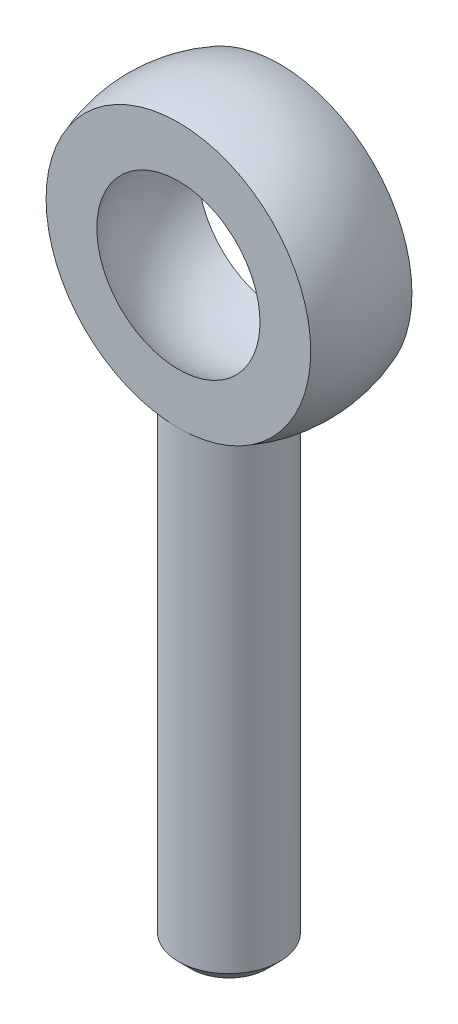
ISO-10303-21;
HEADER;
FILE_DESCRIPTION(('STEP AP214'),'2;1');
FILE_NAME('part.step','',(''),(''),'','','');
FILE_SCHEMA(('AUTOMOTIVE_DESIGN { 1 0 10303 214 1 1 1 1 }'));
ENDSEC;
DATA;
#1=APPLICATION_CONTEXT('core data for automotive mechanical design processes');
#2=APPLICATION_PROTOCOL_DEFINITION('international standard','automotive_design',2000,#1);
#3=PRODUCT_CONTEXT('',#1,'mechanical');
#4=PRODUCT('Part','Part','',(#3));
#5=PRODUCT_RELATED_PRODUCT_CATEGORY('part','',(#4));
#6=PRODUCT_DEFINITION_FORMATION('','',#4);
#7=PRODUCT_DEFINITION_CONTEXT('part definition',#1,'design');
#8=PRODUCT_DEFINITION('design','',#6,#7);
#9=PRODUCT_DEFINITION_SHAPE('','',#8);
#10=(LENGTH_UNIT() NAMED_UNIT(*) SI_UNIT(.MILLI.,.METRE.));
#11=(NAMED_UNIT(*) PLANE_ANGLE_UNIT() SI_UNIT($,.RADIAN.));
#12=(NAMED_UNIT(*) SI_UNIT($,.STERADIAN.) SOLID_ANGLE_UNIT());
#13=UNCERTAINTY_MEASURE_WITH_UNIT(LENGTH_MEASURE(1.E-05),#10,'distance_accuracy_value','');
#14=(GEOMETRIC_REPRESENTATION_CONTEXT(3) GLOBAL_UNCERTAINTY_ASSIGNED_CONTEXT((#13)) GLOBAL_UNIT_ASSIGNED_CONTEXT((#10,
#11,#12)) REPRESENTATION_CONTEXT('',''));
#15=CARTESIAN_POINT('',(0.,0.,0.));
#16=DIRECTION('',(0.,0.,1.));
#17=DIRECTION('',(1.,0.,0.));
#18=AXIS2_PLACEMENT_3D('',#15,#16,#17);
#19=CARTESIAN_POINT('',(0.,0.,0.));
#20=DIRECTION('',(0.,0.,1.));
#21=DIRECTION('',(0.,1.,0.));
#22=AXIS2_PLACEMENT_3D('',#19,#20,#21);
#23=SPHERICAL_SURFACE('',#22,11.1125);
#24=CARTESIAN_POINT('',(0.,-10.3796281093062,0.));
#25=DIRECTION('',(0.,1.,0.));
#26=DIRECTION('',(0.,0.,1.));
#27=AXIS2_PLACEMENT_3D('',#24,#25,#26);
#28=CIRCLE('',#27,3.96875);
#29=CARTESIAN_POINT('',(0.,-10.3796281093062,3.96875));
#30=VERTEX_POINT('',#29);
#31=CARTESIAN_POINT('',(0.,-10.3796281093062,-3.96875));
#32=VERTEX_POINT('',#31);
#33=EDGE_CURVE('E62',#30,#32,#28,.F.);
#34=ORIENTED_EDGE('',*,*,#33,.F.);
#35=CARTESIAN_POINT('',(0.,0.,3.96875));
#36=DIRECTION('',(0.,0.,1.));
#37=DIRECTION('',(0.,-1.,0.));
#38=AXIS2_PLACEMENT_3D('',#35,#36,#37);
#39=CIRCLE('',#38,10.3796281093062);
#40=EDGE_CURVE('E60',#30,#30,#39,.T.);
#41=ORIENTED_EDGE('',*,*,#40,.F.);
#42=EDGE_CURVE('E57',#32,#30,#28,.F.);
#43=ORIENTED_EDGE('',*,*,#42,.F.);
#44=CARTESIAN_POINT('',(0.,0.,-3.96875000000001));
#45=DIRECTION('',(0.,0.,1.));
#46=DIRECTION('',(0.,-1.,0.));
#47=AXIS2_PLACEMENT_3D('',#44,#45,#46);
#48=CIRCLE('',#47,10.3796281093062);
#49=EDGE_CURVE('E64',#32,#32,#48,.T.);
#50=ORIENTED_EDGE('',*,*,#49,.T.);
#51=EDGE_LOOP('',(#34,#41,#43,#50));
#52=FACE_BOUND('',#51,.T.);
#53=ADVANCED_FACE('F42',(#52),#23,.T.);
#54=CARTESIAN_POINT('',(0.,0.,-3.96875000000001));
#55=DIRECTION('',(0.,0.,1.));
#56=DIRECTION('',(0.,-1.,0.));
#57=AXIS2_PLACEMENT_3D('',#54,#55,#56);
#58=PLANE('',#57);
#59=ORIENTED_EDGE('',*,*,#49,.F.);
#60=EDGE_LOOP('',(#59));
#61=FACE_BOUND('',#60,.T.);
#62=CARTESIAN_POINT('',(0.,0.,-3.96875000000001));
#63=DIRECTION('',(0.,0.,1.));
#64=DIRECTION('',(0.,-1.,0.));
#65=AXIS2_PLACEMENT_3D('',#62,#63,#64);
#66=CIRCLE('',#65,6.40050706174909);
#67=CARTESIAN_POINT('',(0.,-6.40050706174909,-3.96875000000001));
#68=VERTEX_POINT('',#67);
#69=EDGE_CURVE('E65',#68,#68,#66,.F.);
#70=ORIENTED_EDGE('',*,*,#69,.F.);
#71=EDGE_LOOP('',(#70));
#72=FACE_BOUND('',#71,.T.);
#73=ADVANCED_FACE('F93',(#61,#72),#58,.F.);
#74=CARTESIAN_POINT('',(0.,10.3796281093062,3.96875));
#75=DIRECTION('',(0.,0.,-1.));
#76=DIRECTION('',(0.,1.,0.));
#77=AXIS2_PLACEMENT_3D('',#74,#75,#76);
#78=PLANE('',#77);
#79=ORIENTED_EDGE('',*,*,#40,.T.);
#80=EDGE_LOOP('',(#79));
#81=FACE_BOUND('',#80,.T.);
#82=CARTESIAN_POINT('',(0.,0.,3.96875));
#83=DIRECTION('',(0.,0.,-1.));
#84=DIRECTION('',(0.,1.,0.));
#85=AXIS2_PLACEMENT_3D('',#82,#83,#84);
#86=CIRCLE('',#85,6.40050706174909);
#87=CARTESIAN_POINT('',(0.,6.40050706174909,3.96875));
#88=VERTEX_POINT('',#87);
#89=EDGE_CURVE('E69',#88,#88,#86,.F.);
#90=ORIENTED_EDGE('',*,*,#89,.F.);
#91=EDGE_LOOP('',(#90));
#92=FACE_BOUND('',#91,.T.);
#93=ADVANCED_FACE('F89',(#81,#92),#78,.F.);
#94=CARTESIAN_POINT('',(0.,0.,0.));
#95=DIRECTION('',(0.,1.,0.));
#96=DIRECTION('',(0.,0.,-1.));
#97=AXIS2_PLACEMENT_3D('',#94,#95,#96);
#98=SPHERICAL_SURFACE('',#97,7.5311);
#99=CARTESIAN_POINT('',(0.,0.,0.));
#100=DIRECTION('',(0.,0.,-1.));
#101=DIRECTION('',(0.,1.,0.));
#102=AXIS2_PLACEMENT_3D('',#99,#100,#101);
#103=SPHERICAL_SURFACE('',#102,7.5311);
#104=ORIENTED_EDGE('',*,*,#89,.T.);
#105=EDGE_LOOP('',(#104));
#106=FACE_BOUND('',#105,.T.);
#107=ORIENTED_EDGE('',*,*,#69,.T.);
#108=EDGE_LOOP('',(#107));
#109=FACE_BOUND('',#108,.T.);
#110=ADVANCED_FACE('F81',(#106,#109),#103,.F.);
#111=CARTESIAN_POINT('',(0.,-8.1125,0.));
#112=DIRECTION('',(0.,-1.,0.));
#113=DIRECTION('',(0.,0.,-1.));
#114=AXIS2_PLACEMENT_3D('',#111,#112,#113);
#115=CYLINDRICAL_SURFACE('',#114,3.96875);
#116=CARTESIAN_POINT('',(0.,-46.6325,0.));
#117=DIRECTION('',(0.,1.,0.));
#118=DIRECTION('',(0.,0.,1.));
#119=AXIS2_PLACEMENT_3D('',#116,#117,#118);
#120=CIRCLE('',#119,3.96875);
#121=CARTESIAN_POINT('',(0.,-46.6325,3.96875));
#122=VERTEX_POINT('',#121);
#123=EDGE_CURVE('E50',#122,#122,#120,.T.);
#124=ORIENTED_EDGE('',*,*,#123,.T.);
#125=EDGE_LOOP('',(#124));
#126=FACE_BOUND('',#125,.T.);
#127=ORIENTED_EDGE('',*,*,#42,.T.);
#128=ORIENTED_EDGE('',*,*,#33,.T.);
#129=EDGE_LOOP('',(#127,#128));
#130=FACE_BOUND('',#129,.T.);
#131=ADVANCED_FACE('F78',(#126,#130),#115,.T.);
#132=CARTESIAN_POINT('',(0.,-47.6325,0.));
#133=DIRECTION('',(0.,1.,0.));
#134=DIRECTION('',(0.,0.,1.));
#135=AXIS2_PLACEMENT_3D('',#132,#133,#134);
#136=PLANE('',#135);
#137=CARTESIAN_POINT('',(0.,-47.6325,0.));
#138=DIRECTION('',(0.,1.,0.));
#139=DIRECTION('',(0.,0.,1.));
#140=AXIS2_PLACEMENT_3D('',#137,#138,#139);
#141=CIRCLE('',#140,2.96874999999998);
#142=CARTESIAN_POINT('',(0.,-47.6325,2.96874999999998));
#143=VERTEX_POINT('',#142);
#144=EDGE_CURVE('E11',#143,#143,#141,.F.);
#145=ORIENTED_EDGE('',*,*,#144,.T.);
#146=EDGE_LOOP('',(#145));
#147=FACE_BOUND('',#146,.T.);
#148=ADVANCED_FACE('F80',(#147),#136,.F.);
#149=CARTESIAN_POINT('',(0.,-46.6325,0.));
#150=DIRECTION('',(0.,1.,0.));
#151=DIRECTION('',(0.,0.,1.));
#152=AXIS2_PLACEMENT_3D('',#149,#150,#151);
#153=CONICAL_SURFACE('',#152,3.96875,0.785398163397452);
#154=ORIENTED_EDGE('',*,*,#144,.F.);
#155=EDGE_LOOP('',(#154));
#156=FACE_BOUND('',#155,.T.);
#157=ORIENTED_EDGE('',*,*,#123,.F.);
#158=EDGE_LOOP('',(#157));
#159=FACE_BOUND('',#158,.T.);
#160=ADVANCED_FACE('F44',(#156,#159),#153,.T.);
#161=CLOSED_SHELL('',(#53,#73,#93,#110,#131,#148,#160));
#162=MANIFOLD_SOLID_BREP('B2',#161);
#163=ADVANCED_BREP_SHAPE_REPRESENTATION('',(#18,#162),#14);
#164=SHAPE_DEFINITION_REPRESENTATION(#9,#163);
ENDSEC;
END-ISO-10303-21;
